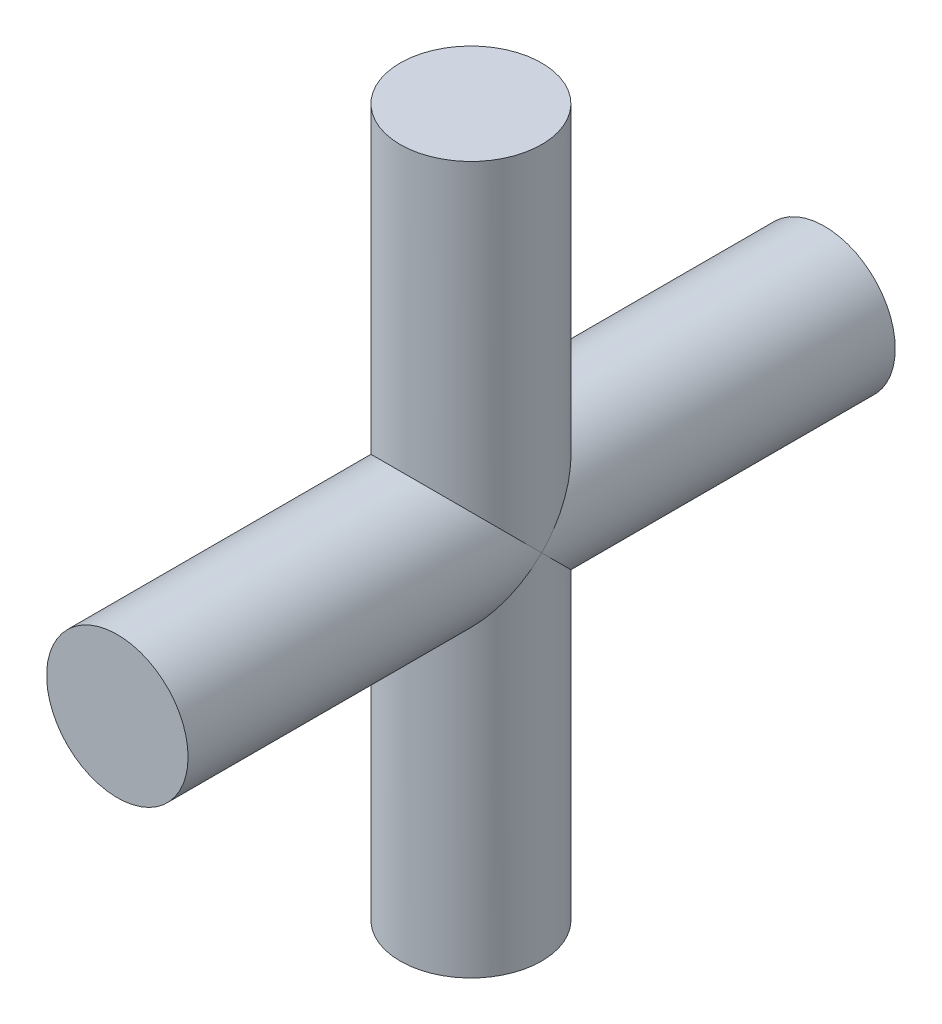
ISO-10303-21;
HEADER;
FILE_DESCRIPTION(('STEP AP214'),'2;1');
FILE_NAME('part.step','',(''),(''),'','','');
FILE_SCHEMA(('AUTOMOTIVE_DESIGN { 1 0 10303 214 1 1 1 1 }'));
ENDSEC;
DATA;
#1=APPLICATION_CONTEXT('core data for automotive mechanical design processes');
#2=APPLICATION_PROTOCOL_DEFINITION('international standard','automotive_design',2000,#1);
#3=PRODUCT_CONTEXT('',#1,'mechanical');
#4=PRODUCT('Part','Part','',(#3));
#5=PRODUCT_RELATED_PRODUCT_CATEGORY('part','',(#4));
#6=PRODUCT_DEFINITION_FORMATION('','',#4);
#7=PRODUCT_DEFINITION_CONTEXT('part definition',#1,'design');
#8=PRODUCT_DEFINITION('design','',#6,#7);
#9=PRODUCT_DEFINITION_SHAPE('','',#8);
#10=(LENGTH_UNIT() NAMED_UNIT(*) SI_UNIT(.MILLI.,.METRE.));
#11=(NAMED_UNIT(*) PLANE_ANGLE_UNIT() SI_UNIT($,.RADIAN.));
#12=(NAMED_UNIT(*) SI_UNIT($,.STERADIAN.) SOLID_ANGLE_UNIT());
#13=UNCERTAINTY_MEASURE_WITH_UNIT(LENGTH_MEASURE(1.E-05),#10,'distance_accuracy_value','');
#14=(GEOMETRIC_REPRESENTATION_CONTEXT(3) GLOBAL_UNCERTAINTY_ASSIGNED_CONTEXT((#13)) GLOBAL_UNIT_ASSIGNED_CONTEXT((#10,
#11,#12)) REPRESENTATION_CONTEXT('',''));
#15=CARTESIAN_POINT('',(0.,0.,0.));
#16=DIRECTION('',(0.,0.,1.));
#17=DIRECTION('',(1.,0.,0.));
#18=AXIS2_PLACEMENT_3D('',#15,#16,#17);
#19=CARTESIAN_POINT('',(0.,0.,50.));
#20=DIRECTION('',(0.,0.,-1.));
#21=DIRECTION('',(-1.,0.,0.));
#22=AXIS2_PLACEMENT_3D('',#19,#20,#21);
#23=CYLINDRICAL_SURFACE('',#22,5.);
#24=CARTESIAN_POINT('',(0.,0.,25.));
#25=DIRECTION('',(0.,-0.707106781186547,-0.707106781186547));
#26=DIRECTION('',(0.,0.707106781186547,-0.707106781186547));
#27=AXIS2_PLACEMENT_3D('',#24,#25,#26);
#28=ELLIPSE('',#27,7.07106781186548,5.);
#29=CARTESIAN_POINT('',(-5.,0.,25.));
#30=VERTEX_POINT('',#29);
#31=CARTESIAN_POINT('',(5.,0.,25.));
#32=VERTEX_POINT('',#31);
#33=EDGE_CURVE('E51',#30,#32,#28,.T.);
#34=ORIENTED_EDGE('',*,*,#33,.T.);
#35=CARTESIAN_POINT('',(0.,0.,25.));
#36=DIRECTION('',(0.,0.707106781186547,-0.707106781186547));
#37=DIRECTION('',(0.,-0.707106781186547,-0.707106781186547));
#38=AXIS2_PLACEMENT_3D('',#35,#36,#37);
#39=ELLIPSE('',#38,7.07106781186548,5.);
#40=EDGE_CURVE('E40',#32,#30,#39,.T.);
#41=ORIENTED_EDGE('',*,*,#40,.T.);
#42=EDGE_LOOP('',(#34,#41));
#43=FACE_BOUND('',#42,.T.);
#44=CARTESIAN_POINT('',(0.,0.,0.));
#45=DIRECTION('',(0.,0.,1.));
#46=DIRECTION('',(1.,0.,0.));
#47=AXIS2_PLACEMENT_3D('',#44,#45,#46);
#48=CIRCLE('',#47,5.);
#49=CARTESIAN_POINT('',(5.,0.,0.));
#50=VERTEX_POINT('',#49);
#51=EDGE_CURVE('E63',#50,#50,#48,.T.);
#52=ORIENTED_EDGE('',*,*,#51,.T.);
#53=EDGE_LOOP('',(#52));
#54=FACE_BOUND('',#53,.T.);
#55=ADVANCED_FACE('F33',(#43,#54),#23,.T.);
#56=CARTESIAN_POINT('',(0.,0.,0.));
#57=DIRECTION('',(0.,0.,1.));
#58=DIRECTION('',(1.,0.,0.));
#59=AXIS2_PLACEMENT_3D('',#56,#57,#58);
#60=PLANE('',#59);
#61=ORIENTED_EDGE('',*,*,#51,.F.);
#62=EDGE_LOOP('',(#61));
#63=FACE_BOUND('',#62,.T.);
#64=ADVANCED_FACE('F78',(#63),#60,.F.);
#65=CARTESIAN_POINT('',(0.,-25.,25.));
#66=DIRECTION('',(0.,1.,0.));
#67=DIRECTION('',(0.,0.,1.));
#68=AXIS2_PLACEMENT_3D('',#65,#66,#67);
#69=PLANE('',#68);
#70=CARTESIAN_POINT('',(0.,-25.,25.));
#71=DIRECTION('',(0.,1.,0.));
#72=DIRECTION('',(0.,0.,1.));
#73=AXIS2_PLACEMENT_3D('',#70,#71,#72);
#74=CIRCLE('',#73,5.);
#75=CARTESIAN_POINT('',(0.,-25.,30.));
#76=VERTEX_POINT('',#75);
#77=EDGE_CURVE('E66',#76,#76,#74,.T.);
#78=ORIENTED_EDGE('',*,*,#77,.F.);
#79=EDGE_LOOP('',(#78));
#80=FACE_BOUND('',#79,.T.);
#81=ADVANCED_FACE('F76',(#80),#69,.F.);
#82=CARTESIAN_POINT('',(0.,-25.,25.));
#83=DIRECTION('',(0.,1.,0.));
#84=DIRECTION('',(0.,0.,1.));
#85=AXIS2_PLACEMENT_3D('',#82,#83,#84);
#86=CYLINDRICAL_SURFACE('',#85,5.);
#87=ORIENTED_EDGE('',*,*,#77,.T.);
#88=EDGE_LOOP('',(#87));
#89=FACE_BOUND('',#88,.T.);
#90=ORIENTED_EDGE('',*,*,#40,.F.);
#91=CARTESIAN_POINT('',(0.,0.,25.));
#92=DIRECTION('',(0.,-0.707106781186547,-0.707106781186547));
#93=DIRECTION('',(0.,0.707106781186547,-0.707106781186547));
#94=AXIS2_PLACEMENT_3D('',#91,#92,#93);
#95=ELLIPSE('',#94,7.07106781186548,5.);
#96=EDGE_CURVE('E45',#30,#32,#95,.F.);
#97=ORIENTED_EDGE('',*,*,#96,.F.);
#98=EDGE_LOOP('',(#90,#97));
#99=FACE_BOUND('',#98,.T.);
#100=ADVANCED_FACE('F57',(#89,#99),#86,.T.);
#101=CARTESIAN_POINT('',(0.,25.,25.));
#102=DIRECTION('',(0.,1.,0.));
#103=DIRECTION('',(0.,0.,1.));
#104=AXIS2_PLACEMENT_3D('',#101,#102,#103);
#105=CIRCLE('',#104,5.);
#106=CARTESIAN_POINT('',(0.,25.,30.));
#107=VERTEX_POINT('',#106);
#108=EDGE_CURVE('E69',#107,#107,#105,.T.);
#109=ORIENTED_EDGE('',*,*,#108,.F.);
#110=EDGE_LOOP('',(#109));
#111=FACE_BOUND('',#110,.T.);
#112=CARTESIAN_POINT('',(0.,0.,25.));
#113=DIRECTION('',(0.,0.707106781186547,-0.707106781186547));
#114=DIRECTION('',(0.,-0.707106781186547,-0.707106781186547));
#115=AXIS2_PLACEMENT_3D('',#112,#113,#114);
#116=ELLIPSE('',#115,7.07106781186548,5.);
#117=EDGE_CURVE('E11',#32,#30,#116,.F.);
#118=ORIENTED_EDGE('',*,*,#117,.F.);
#119=ORIENTED_EDGE('',*,*,#33,.F.);
#120=EDGE_LOOP('',(#118,#119));
#121=FACE_BOUND('',#120,.T.);
#122=ADVANCED_FACE('F52',(#111,#121),#86,.T.);
#123=CARTESIAN_POINT('',(0.,25.,25.));
#124=DIRECTION('',(0.,1.,0.));
#125=DIRECTION('',(0.,0.,1.));
#126=AXIS2_PLACEMENT_3D('',#123,#124,#125);
#127=PLANE('',#126);
#128=ORIENTED_EDGE('',*,*,#108,.T.);
#129=EDGE_LOOP('',(#128));
#130=FACE_BOUND('',#129,.T.);
#131=ADVANCED_FACE('F96',(#130),#127,.T.);
#132=CARTESIAN_POINT('',(0.,0.,50.));
#133=DIRECTION('',(0.,0.,1.));
#134=DIRECTION('',(1.,0.,0.));
#135=AXIS2_PLACEMENT_3D('',#132,#133,#134);
#136=PLANE('',#135);
#137=CARTESIAN_POINT('',(0.,0.,50.));
#138=DIRECTION('',(0.,0.,1.));
#139=DIRECTION('',(1.,0.,0.));
#140=AXIS2_PLACEMENT_3D('',#137,#138,#139);
#141=CIRCLE('',#140,5.);
#142=CARTESIAN_POINT('',(5.,0.,50.));
#143=VERTEX_POINT('',#142);
#144=EDGE_CURVE('E58',#143,#143,#141,.T.);
#145=ORIENTED_EDGE('',*,*,#144,.T.);
#146=EDGE_LOOP('',(#145));
#147=FACE_BOUND('',#146,.T.);
#148=ADVANCED_FACE('F91',(#147),#136,.T.);
#149=ORIENTED_EDGE('',*,*,#144,.F.);
#150=EDGE_LOOP('',(#149));
#151=FACE_BOUND('',#150,.T.);
#152=ORIENTED_EDGE('',*,*,#96,.T.);
#153=ORIENTED_EDGE('',*,*,#117,.T.);
#154=EDGE_LOOP('',(#152,#153));
#155=FACE_BOUND('',#154,.T.);
#156=ADVANCED_FACE('F60',(#151,#155),#23,.T.);
#157=CLOSED_SHELL('',(#55,#64,#81,#100,#122,#131,#148,#156));
#158=MANIFOLD_SOLID_BREP('B2',#157);
#159=ADVANCED_BREP_SHAPE_REPRESENTATION('',(#18,#158),#14);
#160=SHAPE_DEFINITION_REPRESENTATION(#9,#159);
ENDSEC;
END-ISO-10303-21;
